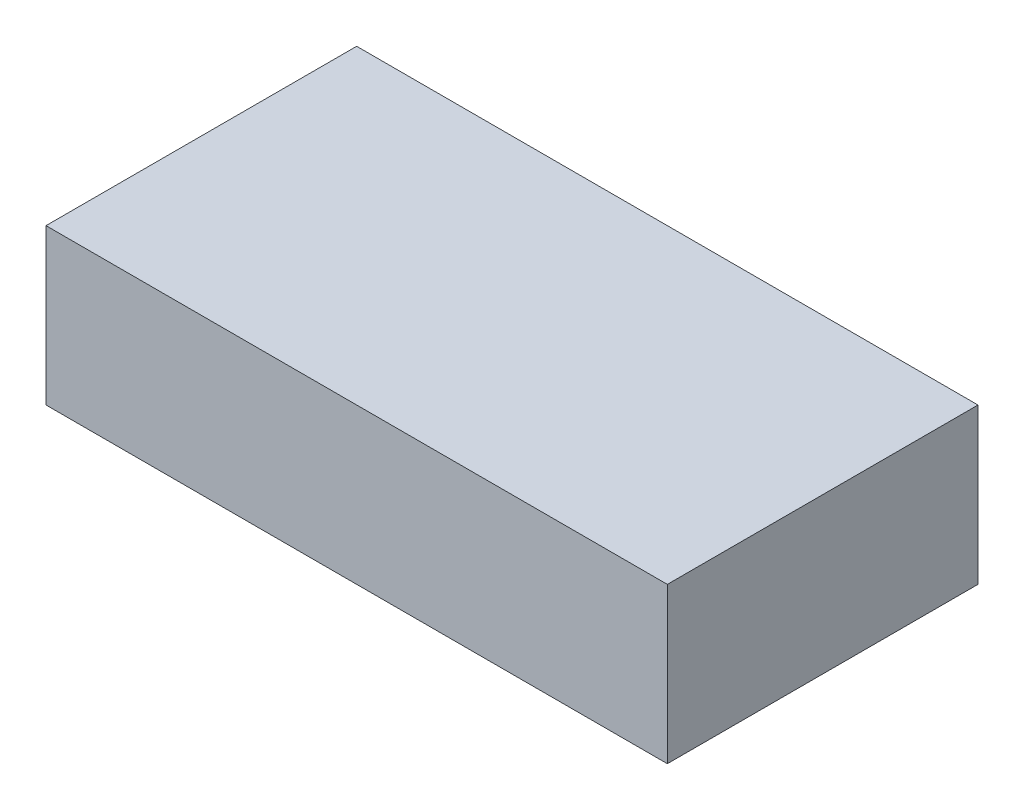
ISO-10303-21;
HEADER;
FILE_DESCRIPTION(('STEP AP214'),'2;1');
FILE_NAME('part.step','',(''),(''),'','','');
FILE_SCHEMA(('AUTOMOTIVE_DESIGN { 1 0 10303 214 1 1 1 1 }'));
ENDSEC;
DATA;
#1=APPLICATION_CONTEXT('core data for automotive mechanical design processes');
#2=APPLICATION_PROTOCOL_DEFINITION('international standard','automotive_design',2000,#1);
#3=PRODUCT_CONTEXT('',#1,'mechanical');
#4=PRODUCT('Part','Part','',(#3));
#5=PRODUCT_RELATED_PRODUCT_CATEGORY('part','',(#4));
#6=PRODUCT_DEFINITION_FORMATION('','',#4);
#7=PRODUCT_DEFINITION_CONTEXT('part definition',#1,'design');
#8=PRODUCT_DEFINITION('design','',#6,#7);
#9=PRODUCT_DEFINITION_SHAPE('','',#8);
#10=(LENGTH_UNIT() NAMED_UNIT(*) SI_UNIT(.MILLI.,.METRE.));
#11=(NAMED_UNIT(*) PLANE_ANGLE_UNIT() SI_UNIT($,.RADIAN.));
#12=(NAMED_UNIT(*) SI_UNIT($,.STERADIAN.) SOLID_ANGLE_UNIT());
#13=UNCERTAINTY_MEASURE_WITH_UNIT(LENGTH_MEASURE(1.E-05),#10,'distance_accuracy_value','');
#14=(GEOMETRIC_REPRESENTATION_CONTEXT(3) GLOBAL_UNCERTAINTY_ASSIGNED_CONTEXT((#13)) GLOBAL_UNIT_ASSIGNED_CONTEXT((#10,
#11,#12)) REPRESENTATION_CONTEXT('',''));
#15=CARTESIAN_POINT('',(0.,0.,0.));
#16=DIRECTION('',(0.,0.,1.));
#17=DIRECTION('',(1.,0.,0.));
#18=AXIS2_PLACEMENT_3D('',#15,#16,#17);
#19=CARTESIAN_POINT('',(0.,0.,10.));
#20=DIRECTION('',(1.,0.,0.));
#21=DIRECTION('',(0.,1.,0.));
#22=AXIS2_PLACEMENT_3D('',#19,#20,#21);
#23=PLANE('',#22);
#24=DIRECTION('',(0.,-1.,0.));
#25=VECTOR('',#24,1.);
#26=CARTESIAN_POINT('',(0.,0.,0.));
#27=LINE('',#26,#25);
#28=CARTESIAN_POINT('',(0.,0.,0.));
#29=VERTEX_POINT('',#28);
#30=CARTESIAN_POINT('',(0.,-5.,0.));
#31=VERTEX_POINT('',#30);
#32=EDGE_CURVE('E96',#29,#31,#27,.T.);
#33=ORIENTED_EDGE('',*,*,#32,.T.);
#34=DIRECTION('',(0.,0.,-1.));
#35=VECTOR('',#34,1.);
#36=CARTESIAN_POINT('',(0.,-5.,10.));
#37=LINE('',#36,#35);
#38=CARTESIAN_POINT('',(0.,-5.,10.));
#39=VERTEX_POINT('',#38);
#40=EDGE_CURVE('E11',#39,#31,#37,.T.);
#41=ORIENTED_EDGE('',*,*,#40,.F.);
#42=DIRECTION('',(0.,-1.,0.));
#43=VECTOR('',#42,1.);
#44=CARTESIAN_POINT('',(0.,0.,10.));
#45=LINE('',#44,#43);
#46=CARTESIAN_POINT('',(0.,0.,10.));
#47=VERTEX_POINT('',#46);
#48=EDGE_CURVE('E84',#47,#39,#45,.T.);
#49=ORIENTED_EDGE('',*,*,#48,.F.);
#50=DIRECTION('',(0.,0.,-1.));
#51=VECTOR('',#50,1.);
#52=CARTESIAN_POINT('',(0.,0.,10.));
#53=LINE('',#52,#51);
#54=EDGE_CURVE('E92',#47,#29,#53,.T.);
#55=ORIENTED_EDGE('',*,*,#54,.T.);
#56=EDGE_LOOP('',(#33,#41,#49,#55));
#57=FACE_BOUND('',#56,.T.);
#58=ADVANCED_FACE('F33',(#57),#23,.F.);
#59=CARTESIAN_POINT('',(0.,-5.,10.));
#60=DIRECTION('',(0.,1.,0.));
#61=DIRECTION('',(0.,0.,1.));
#62=AXIS2_PLACEMENT_3D('',#59,#60,#61);
#63=PLANE('',#62);
#64=DIRECTION('',(1.,0.,0.));
#65=VECTOR('',#64,1.);
#66=CARTESIAN_POINT('',(0.,-5.,0.));
#67=LINE('',#66,#65);
#68=CARTESIAN_POINT('',(20.,-5.,0.));
#69=VERTEX_POINT('',#68);
#70=EDGE_CURVE('E88',#31,#69,#67,.T.);
#71=ORIENTED_EDGE('',*,*,#70,.T.);
#72=DIRECTION('',(0.,0.,-1.));
#73=VECTOR('',#72,1.);
#74=CARTESIAN_POINT('',(20.,-5.,10.));
#75=LINE('',#74,#73);
#76=CARTESIAN_POINT('',(20.,-5.,10.));
#77=VERTEX_POINT('',#76);
#78=EDGE_CURVE('E41',#77,#69,#75,.T.);
#79=ORIENTED_EDGE('',*,*,#78,.F.);
#80=DIRECTION('',(1.,0.,0.));
#81=VECTOR('',#80,1.);
#82=CARTESIAN_POINT('',(0.,-5.,10.));
#83=LINE('',#82,#81);
#84=EDGE_CURVE('E79',#39,#77,#83,.T.);
#85=ORIENTED_EDGE('',*,*,#84,.F.);
#86=ORIENTED_EDGE('',*,*,#40,.T.);
#87=EDGE_LOOP('',(#71,#79,#85,#86));
#88=FACE_BOUND('',#87,.T.);
#89=ADVANCED_FACE('F87',(#88),#63,.F.);
#90=CARTESIAN_POINT('',(20.,0.,10.));
#91=DIRECTION('',(-1.,0.,0.));
#92=DIRECTION('',(0.,0.,1.));
#93=AXIS2_PLACEMENT_3D('',#90,#91,#92);
#94=PLANE('',#93);
#95=DIRECTION('',(0.,1.,0.));
#96=VECTOR('',#95,1.);
#97=CARTESIAN_POINT('',(20.,0.,0.));
#98=LINE('',#97,#96);
#99=CARTESIAN_POINT('',(20.,0.,0.));
#100=VERTEX_POINT('',#99);
#101=EDGE_CURVE('E66',#69,#100,#98,.T.);
#102=ORIENTED_EDGE('',*,*,#101,.T.);
#103=DIRECTION('',(0.,0.,-1.));
#104=VECTOR('',#103,1.);
#105=CARTESIAN_POINT('',(20.,0.,10.));
#106=LINE('',#105,#104);
#107=CARTESIAN_POINT('',(20.,0.,10.));
#108=VERTEX_POINT('',#107);
#109=EDGE_CURVE('E89',#108,#100,#106,.T.);
#110=ORIENTED_EDGE('',*,*,#109,.F.);
#111=DIRECTION('',(0.,1.,0.));
#112=VECTOR('',#111,1.);
#113=CARTESIAN_POINT('',(20.,0.,10.));
#114=LINE('',#113,#112);
#115=EDGE_CURVE('E82',#77,#108,#114,.T.);
#116=ORIENTED_EDGE('',*,*,#115,.F.);
#117=ORIENTED_EDGE('',*,*,#78,.T.);
#118=EDGE_LOOP('',(#102,#110,#116,#117));
#119=FACE_BOUND('',#118,.T.);
#120=ADVANCED_FACE('F90',(#119),#94,.F.);
#121=CARTESIAN_POINT('',(0.,0.,10.));
#122=DIRECTION('',(0.,-1.,0.));
#123=DIRECTION('',(0.,0.,-1.));
#124=AXIS2_PLACEMENT_3D('',#121,#122,#123);
#125=PLANE('',#124);
#126=DIRECTION('',(-1.,0.,0.));
#127=VECTOR('',#126,1.);
#128=CARTESIAN_POINT('',(0.,0.,0.));
#129=LINE('',#128,#127);
#130=EDGE_CURVE('E72',#100,#29,#129,.T.);
#131=ORIENTED_EDGE('',*,*,#130,.T.);
#132=ORIENTED_EDGE('',*,*,#54,.F.);
#133=DIRECTION('',(-1.,0.,0.));
#134=VECTOR('',#133,1.);
#135=CARTESIAN_POINT('',(0.,0.,10.));
#136=LINE('',#135,#134);
#137=EDGE_CURVE('E49',#108,#47,#136,.T.);
#138=ORIENTED_EDGE('',*,*,#137,.F.);
#139=ORIENTED_EDGE('',*,*,#109,.T.);
#140=EDGE_LOOP('',(#131,#132,#138,#139));
#141=FACE_BOUND('',#140,.T.);
#142=ADVANCED_FACE('F103',(#141),#125,.F.);
#143=CARTESIAN_POINT('',(0.,0.,10.));
#144=DIRECTION('',(0.,0.,1.));
#145=DIRECTION('',(1.,0.,0.));
#146=AXIS2_PLACEMENT_3D('',#143,#144,#145);
#147=PLANE('',#146);
#148=ORIENTED_EDGE('',*,*,#48,.T.);
#149=ORIENTED_EDGE('',*,*,#84,.T.);
#150=ORIENTED_EDGE('',*,*,#115,.T.);
#151=ORIENTED_EDGE('',*,*,#137,.T.);
#152=EDGE_LOOP('',(#148,#149,#150,#151));
#153=FACE_BOUND('',#152,.T.);
#154=ADVANCED_FACE('F80',(#153),#147,.T.);
#155=CARTESIAN_POINT('',(0.,0.,0.));
#156=DIRECTION('',(0.,0.,1.));
#157=DIRECTION('',(1.,0.,0.));
#158=AXIS2_PLACEMENT_3D('',#155,#156,#157);
#159=PLANE('',#158);
#160=ORIENTED_EDGE('',*,*,#32,.F.);
#161=ORIENTED_EDGE('',*,*,#130,.F.);
#162=ORIENTED_EDGE('',*,*,#101,.F.);
#163=ORIENTED_EDGE('',*,*,#70,.F.);
#164=EDGE_LOOP('',(#160,#161,#162,#163));
#165=FACE_BOUND('',#164,.T.);
#166=ADVANCED_FACE('F106',(#165),#159,.F.);
#167=CLOSED_SHELL('',(#58,#89,#120,#142,#154,#166));
#168=MANIFOLD_SOLID_BREP('B2',#167);
#169=ADVANCED_BREP_SHAPE_REPRESENTATION('',(#18,#168),#14);
#170=SHAPE_DEFINITION_REPRESENTATION(#9,#169);
ENDSEC;
END-ISO-10303-21;
